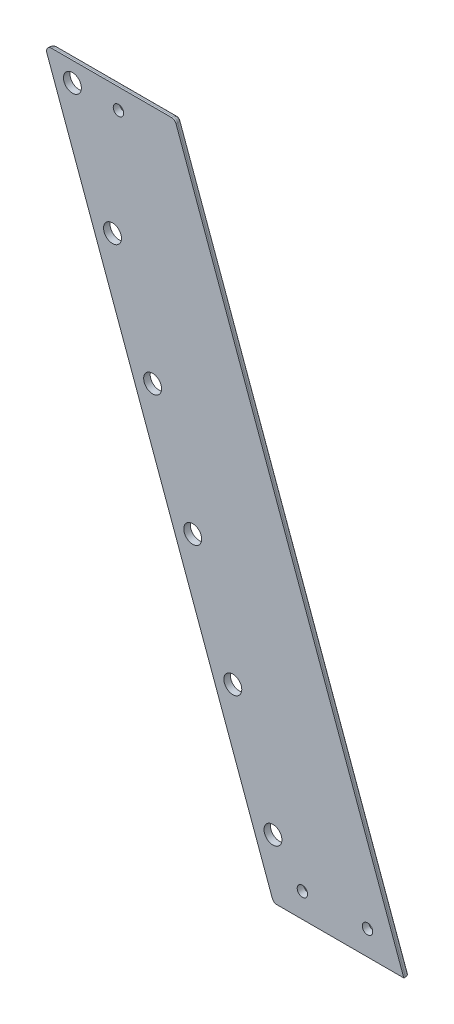
ISO-10303-21;
HEADER;
FILE_DESCRIPTION(('STEP AP214'),'2;1');
FILE_NAME('part.step','',(''),(''),'','','');
FILE_SCHEMA(('AUTOMOTIVE_DESIGN { 1 0 10303 214 1 1 1 1 }'));
ENDSEC;
DATA;
#1=APPLICATION_CONTEXT('core data for automotive mechanical design processes');
#2=APPLICATION_PROTOCOL_DEFINITION('international standard','automotive_design',2000,#1);
#3=PRODUCT_CONTEXT('',#1,'mechanical');
#4=PRODUCT('Part','Part','',(#3));
#5=PRODUCT_RELATED_PRODUCT_CATEGORY('part','',(#4));
#6=PRODUCT_DEFINITION_FORMATION('','',#4);
#7=PRODUCT_DEFINITION_CONTEXT('part definition',#1,'design');
#8=PRODUCT_DEFINITION('design','',#6,#7);
#9=PRODUCT_DEFINITION_SHAPE('','',#8);
#10=(LENGTH_UNIT() NAMED_UNIT(*) SI_UNIT(.MILLI.,.METRE.));
#11=(NAMED_UNIT(*) PLANE_ANGLE_UNIT() SI_UNIT($,.RADIAN.));
#12=(NAMED_UNIT(*) SI_UNIT($,.STERADIAN.) SOLID_ANGLE_UNIT());
#13=UNCERTAINTY_MEASURE_WITH_UNIT(LENGTH_MEASURE(1.E-05),#10,'distance_accuracy_value','');
#14=(GEOMETRIC_REPRESENTATION_CONTEXT(3) GLOBAL_UNCERTAINTY_ASSIGNED_CONTEXT((#13)) GLOBAL_UNIT_ASSIGNED_CONTEXT((#10,
#11,#12)) REPRESENTATION_CONTEXT('',''));
#15=CARTESIAN_POINT('',(0.,0.,0.));
#16=DIRECTION('',(0.,0.,1.));
#17=DIRECTION('',(1.,0.,0.));
#18=AXIS2_PLACEMENT_3D('',#15,#16,#17);
#19=CARTESIAN_POINT('',(0.,164.5,2.));
#20=DIRECTION('',(0.,1.,0.));
#21=DIRECTION('',(0.,0.,1.));
#22=AXIS2_PLACEMENT_3D('',#19,#20,#21);
#23=PLANE('',#22);
#24=DIRECTION('',(1.,0.,0.));
#25=VECTOR('',#24,1.);
#26=CARTESIAN_POINT('',(0.,164.5,0.));
#27=LINE('',#26,#25);
#28=CARTESIAN_POINT('',(-52.1049304307485,164.5,0.));
#29=VERTEX_POINT('',#28);
#30=CARTESIAN_POINT('',(-15.2726947706576,164.5,0.));
#31=VERTEX_POINT('',#30);
#32=EDGE_CURVE('E215',#29,#31,#27,.T.);
#33=ORIENTED_EDGE('',*,*,#32,.T.);
#34=CARTESIAN_POINT('',(-15.2726947706576,164.5,1.5));
#35=DIRECTION('',(0.,1.,0.));
#36=DIRECTION('',(-1.,0.,0.));
#37=AXIS2_PLACEMENT_3D('',#34,#35,#36);
#38=ELLIPSE('',#37,1.59626665871387,1.5);
#39=CARTESIAN_POINT('',(-13.6764281119449,164.5,1.5));
#40=VERTEX_POINT('',#39);
#41=EDGE_CURVE('E134',#31,#40,#38,.F.);
#42=ORIENTED_EDGE('',*,*,#41,.T.);
#43=DIRECTION('',(0.,0.,-1.));
#44=VECTOR('',#43,1.);
#45=CARTESIAN_POINT('',(-13.6764281119449,164.5,2.));
#46=LINE('',#45,#44);
#47=CARTESIAN_POINT('',(-13.6764281119449,164.5,2.));
#48=VERTEX_POINT('',#47);
#49=EDGE_CURVE('E128',#48,#40,#46,.T.);
#50=ORIENTED_EDGE('',*,*,#49,.F.);
#51=DIRECTION('',(1.,0.,0.));
#52=VECTOR('',#51,1.);
#53=CARTESIAN_POINT('',(0.,164.5,2.));
#54=LINE('',#53,#52);
#55=CARTESIAN_POINT('',(-52.6508857821478,164.5,2.));
#56=VERTEX_POINT('',#55);
#57=EDGE_CURVE('E113',#56,#48,#54,.T.);
#58=ORIENTED_EDGE('',*,*,#57,.F.);
#59=DIRECTION('',(0.,0.,-1.));
#60=VECTOR('',#59,1.);
#61=CARTESIAN_POINT('',(-52.6508857821478,164.5,0.));
#62=LINE('',#61,#60);
#63=CARTESIAN_POINT('',(-52.6508857821478,164.5,0.0904610688211416));
#64=VERTEX_POINT('',#63);
#65=EDGE_CURVE('E164',#56,#64,#62,.T.);
#66=ORIENTED_EDGE('',*,*,#65,.T.);
#67=CARTESIAN_POINT('',(-52.1049304307485,164.5,1.5));
#68=DIRECTION('',(0.,1.,0.));
#69=DIRECTION('',(1.,0.,0.));
#70=AXIS2_PLACEMENT_3D('',#67,#68,#69);
#71=ELLIPSE('',#70,1.59626665871387,1.5);
#72=EDGE_CURVE('E167',#64,#29,#71,.F.);
#73=ORIENTED_EDGE('',*,*,#72,.T.);
#74=EDGE_LOOP('',(#33,#42,#50,#58,#66,#73));
#75=FACE_BOUND('',#74,.T.);
#76=ADVANCED_FACE('F41',(#75),#23,.F.);
#77=CARTESIAN_POINT('',(40.7926909623119,14.8473252859019,2.));
#78=DIRECTION('',(-0.939692620785905,-0.342020143325678,0.));
#79=DIRECTION('',(0.342020143325678,-0.939692620785905,0.));
#80=AXIS2_PLACEMENT_3D('',#77,#78,#79);
#81=PLANE('',#80);
#82=ORIENTED_EDGE('',*,*,#49,.T.);
#83=DIRECTION('',(-0.342020143325678,0.939692620785905,0.));
#84=VECTOR('',#83,1.);
#85=CARTESIAN_POINT('',(40.7926909623119,14.8473252859019,1.5));
#86=LINE('',#85,#84);
#87=CARTESIAN_POINT('',(-83.6161119090907,356.657701956452,1.5));
#88=VERTEX_POINT('',#87);
#89=EDGE_CURVE('E59',#40,#88,#86,.T.);
#90=ORIENTED_EDGE('',*,*,#89,.T.);
#91=DIRECTION('',(0.,0.,-1.));
#92=VECTOR('',#91,1.);
#93=CARTESIAN_POINT('',(-83.6161119090907,356.657701956452,2.));
#94=LINE('',#93,#92);
#95=CARTESIAN_POINT('',(-83.6161119090907,356.657701956452,2.));
#96=VERTEX_POINT('',#95);
#97=EDGE_CURVE('E63',#88,#96,#94,.F.);
#98=ORIENTED_EDGE('',*,*,#97,.T.);
#99=DIRECTION('',(-0.342020143325678,0.939692620785905,0.));
#100=VECTOR('',#99,1.);
#101=CARTESIAN_POINT('',(40.7926909623119,14.8473252859019,2.));
#102=LINE('',#101,#100);
#103=EDGE_CURVE('E116',#48,#96,#102,.T.);
#104=ORIENTED_EDGE('',*,*,#103,.F.);
#105=EDGE_LOOP('',(#82,#90,#98,#104));
#106=FACE_BOUND('',#105,.T.);
#107=ADVANCED_FACE('F127',(#106),#81,.F.);
#108=CARTESIAN_POINT('',(0.,357.644671741463,2.));
#109=DIRECTION('',(0.,-1.,0.));
#110=DIRECTION('',(0.,0.,-1.));
#111=AXIS2_PLACEMENT_3D('',#108,#109,#110);
#112=PLANE('',#111);
#113=DIRECTION('',(-1.,0.,0.));
#114=VECTOR('',#113,1.);
#115=CARTESIAN_POINT('',(0.,357.644671741463,2.));
#116=LINE('',#115,#114);
#117=CARTESIAN_POINT('',(-85.0256508402695,357.644671741463,2.));
#118=VERTEX_POINT('',#117);
#119=CARTESIAN_POINT('',(-121.857886500359,357.644671741463,2.));
#120=VERTEX_POINT('',#119);
#121=EDGE_CURVE('E130',#118,#120,#116,.T.);
#122=ORIENTED_EDGE('',*,*,#121,.F.);
#123=DIRECTION('',(0.,0.,-1.));
#124=VECTOR('',#123,1.);
#125=CARTESIAN_POINT('',(-85.0256508402695,357.644671741463,2.));
#126=LINE('',#125,#124);
#127=CARTESIAN_POINT('',(-85.0256508402695,357.644671741463,1.5));
#128=VERTEX_POINT('',#127);
#129=EDGE_CURVE('E178',#118,#128,#126,.T.);
#130=ORIENTED_EDGE('',*,*,#129,.T.);
#131=DIRECTION('',(-1.,0.,0.));
#132=VECTOR('',#131,1.);
#133=CARTESIAN_POINT('',(0.,357.644671741463,1.5));
#134=LINE('',#133,#132);
#135=CARTESIAN_POINT('',(-121.857886500359,357.644671741463,1.5));
#136=VERTEX_POINT('',#135);
#137=EDGE_CURVE('E175',#128,#136,#134,.T.);
#138=ORIENTED_EDGE('',*,*,#137,.T.);
#139=DIRECTION('',(0.,0.,-1.));
#140=VECTOR('',#139,1.);
#141=CARTESIAN_POINT('',(-121.857886500359,357.644671741463,2.));
#142=LINE('',#141,#140);
#143=EDGE_CURVE('E172',#136,#120,#142,.F.);
#144=ORIENTED_EDGE('',*,*,#143,.T.);
#145=EDGE_LOOP('',(#122,#130,#138,#144));
#146=FACE_BOUND('',#145,.T.);
#147=ADVANCED_FACE('F280',(#146),#112,.F.);
#148=CARTESIAN_POINT('',(-44.8223226989863,172.,2.));
#149=DIRECTION('',(0.,0.,-1.));
#150=DIRECTION('',(-1.,0.,0.));
#151=AXIS2_PLACEMENT_3D('',#148,#149,#150);
#152=CYLINDRICAL_SURFACE('',#151,1.6);
#153=CARTESIAN_POINT('',(-44.8223226989863,172.,2.));
#154=DIRECTION('',(0.,0.,1.));
#155=DIRECTION('',(1.,0.,0.));
#156=AXIS2_PLACEMENT_3D('',#153,#154,#155);
#157=CIRCLE('',#156,1.6);
#158=CARTESIAN_POINT('',(-43.2223226989863,172.,2.));
#159=VERTEX_POINT('',#158);
#160=EDGE_CURVE('E144',#159,#159,#157,.T.);
#161=ORIENTED_EDGE('',*,*,#160,.T.);
#162=EDGE_LOOP('',(#161));
#163=FACE_BOUND('',#162,.T.);
#164=CARTESIAN_POINT('',(-44.8223226989863,172.,0.));
#165=DIRECTION('',(0.,0.,1.));
#166=DIRECTION('',(1.,0.,0.));
#167=AXIS2_PLACEMENT_3D('',#164,#165,#166);
#168=CIRCLE('',#167,1.6);
#169=CARTESIAN_POINT('',(-43.2223226989863,172.,0.));
#170=VERTEX_POINT('',#169);
#171=EDGE_CURVE('E249',#170,#170,#168,.T.);
#172=ORIENTED_EDGE('',*,*,#171,.F.);
#173=EDGE_LOOP('',(#172));
#174=FACE_BOUND('',#173,.T.);
#175=ADVANCED_FACE('F357',(#163,#174),#152,.F.);
#176=CARTESIAN_POINT('',(-101.299546660201,351.411510234001,2.));
#177=DIRECTION('',(0.,0.,-1.));
#178=DIRECTION('',(-1.,0.,0.));
#179=AXIS2_PLACEMENT_3D('',#176,#177,#178);
#180=CYLINDRICAL_SURFACE('',#179,1.60000000000002);
#181=CARTESIAN_POINT('',(-101.299546660201,351.411510234001,2.));
#182=DIRECTION('',(0.,0.,1.));
#183=DIRECTION('',(1.,0.,0.));
#184=AXIS2_PLACEMENT_3D('',#181,#182,#183);
#185=CIRCLE('',#184,1.60000000000002);
#186=CARTESIAN_POINT('',(-99.6995466602012,351.411510234001,2.));
#187=VERTEX_POINT('',#186);
#188=EDGE_CURVE('E350',#187,#187,#185,.T.);
#189=ORIENTED_EDGE('',*,*,#188,.T.);
#190=EDGE_LOOP('',(#189));
#191=FACE_BOUND('',#190,.T.);
#192=CARTESIAN_POINT('',(-101.299546660201,351.411510234001,0.));
#193=DIRECTION('',(0.,0.,1.));
#194=DIRECTION('',(1.,0.,0.));
#195=AXIS2_PLACEMENT_3D('',#192,#193,#194);
#196=CIRCLE('',#195,1.60000000000002);
#197=CARTESIAN_POINT('',(-99.6995466602012,351.411510234001,0.));
#198=VERTEX_POINT('',#197);
#199=EDGE_CURVE('E246',#198,#198,#196,.T.);
#200=ORIENTED_EDGE('',*,*,#199,.F.);
#201=EDGE_LOOP('',(#200));
#202=FACE_BOUND('',#201,.T.);
#203=ADVANCED_FACE('F363',(#191,#202),#180,.F.);
#204=CARTESIAN_POINT('',(-115.43122047002,351.644671741463,2.));
#205=DIRECTION('',(0.,0.,-1.));
#206=DIRECTION('',(-1.,0.,0.));
#207=AXIS2_PLACEMENT_3D('',#204,#205,#206);
#208=CYLINDRICAL_SURFACE('',#207,2.75000000000001);
#209=CARTESIAN_POINT('',(-115.43122047002,351.644671741463,2.));
#210=DIRECTION('',(0.,0.,1.));
#211=DIRECTION('',(1.,0.,0.));
#212=AXIS2_PLACEMENT_3D('',#209,#210,#211);
#213=CIRCLE('',#212,2.75000000000001);
#214=CARTESIAN_POINT('',(-112.68122047002,351.644671741463,2.));
#215=VERTEX_POINT('',#214);
#216=EDGE_CURVE('E346',#215,#215,#213,.T.);
#217=ORIENTED_EDGE('',*,*,#216,.T.);
#218=EDGE_LOOP('',(#217));
#219=FACE_BOUND('',#218,.T.);
#220=CARTESIAN_POINT('',(-115.43122047002,351.644671741463,0.));
#221=DIRECTION('',(0.,0.,1.));
#222=DIRECTION('',(1.,0.,0.));
#223=AXIS2_PLACEMENT_3D('',#220,#221,#222);
#224=CIRCLE('',#223,2.75000000000001);
#225=CARTESIAN_POINT('',(-112.68122047002,351.644671741463,0.));
#226=VERTEX_POINT('',#225);
#227=EDGE_CURVE('E242',#226,#226,#224,.T.);
#228=ORIENTED_EDGE('',*,*,#227,.F.);
#229=EDGE_LOOP('',(#228));
#230=FACE_BOUND('',#229,.T.);
#231=ADVANCED_FACE('F368',(#219,#230),#208,.F.);
#232=CARTESIAN_POINT('',(-66.1803198311229,216.328934348293,2.));
#233=DIRECTION('',(0.,0.,-1.));
#234=DIRECTION('',(-1.,0.,0.));
#235=AXIS2_PLACEMENT_3D('',#232,#233,#234);
#236=CYLINDRICAL_SURFACE('',#235,2.75000000000001);
#237=CARTESIAN_POINT('',(-66.1803198311229,216.328934348293,2.));
#238=DIRECTION('',(0.,0.,1.));
#239=DIRECTION('',(1.,0.,0.));
#240=AXIS2_PLACEMENT_3D('',#237,#238,#239);
#241=CIRCLE('',#240,2.75000000000001);
#242=CARTESIAN_POINT('',(-63.4303198311229,216.328934348293,2.));
#243=VERTEX_POINT('',#242);
#244=EDGE_CURVE('E342',#243,#243,#241,.T.);
#245=ORIENTED_EDGE('',*,*,#244,.T.);
#246=EDGE_LOOP('',(#245));
#247=FACE_BOUND('',#246,.T.);
#248=CARTESIAN_POINT('',(-66.1803198311229,216.328934348293,0.));
#249=DIRECTION('',(0.,0.,1.));
#250=DIRECTION('',(1.,0.,0.));
#251=AXIS2_PLACEMENT_3D('',#248,#249,#250);
#252=CIRCLE('',#251,2.75000000000001);
#253=CARTESIAN_POINT('',(-63.4303198311229,216.328934348293,0.));
#254=VERTEX_POINT('',#253);
#255=EDGE_CURVE('E238',#254,#254,#252,.T.);
#256=ORIENTED_EDGE('',*,*,#255,.F.);
#257=EDGE_LOOP('',(#256));
#258=FACE_BOUND('',#257,.T.);
#259=ADVANCED_FACE('F374',(#247,#258),#236,.F.);
#260=CARTESIAN_POINT('',(-78.4930449908471,250.157868696585,2.));
#261=DIRECTION('',(0.,0.,-1.));
#262=DIRECTION('',(-1.,0.,0.));
#263=AXIS2_PLACEMENT_3D('',#260,#261,#262);
#264=CYLINDRICAL_SURFACE('',#263,2.75000000000001);
#265=CARTESIAN_POINT('',(-78.4930449908471,250.157868696585,2.));
#266=DIRECTION('',(0.,0.,1.));
#267=DIRECTION('',(1.,0.,0.));
#268=AXIS2_PLACEMENT_3D('',#265,#266,#267);
#269=CIRCLE('',#268,2.75000000000001);
#270=CARTESIAN_POINT('',(-75.7430449908471,250.157868696585,2.));
#271=VERTEX_POINT('',#270);
#272=EDGE_CURVE('E338',#271,#271,#269,.T.);
#273=ORIENTED_EDGE('',*,*,#272,.T.);
#274=EDGE_LOOP('',(#273));
#275=FACE_BOUND('',#274,.T.);
#276=CARTESIAN_POINT('',(-78.4930449908471,250.157868696585,0.));
#277=DIRECTION('',(0.,0.,1.));
#278=DIRECTION('',(1.,0.,0.));
#279=AXIS2_PLACEMENT_3D('',#276,#277,#278);
#280=CIRCLE('',#279,2.75000000000001);
#281=CARTESIAN_POINT('',(-75.7430449908471,250.157868696585,0.));
#282=VERTEX_POINT('',#281);
#283=EDGE_CURVE('E234',#282,#282,#280,.T.);
#284=ORIENTED_EDGE('',*,*,#283,.F.);
#285=EDGE_LOOP('',(#284));
#286=FACE_BOUND('',#285,.T.);
#287=ADVANCED_FACE('F378',(#275,#286),#264,.F.);
#288=CARTESIAN_POINT('',(-90.8057701505713,283.986803044878,2.));
#289=DIRECTION('',(0.,0.,-1.));
#290=DIRECTION('',(-1.,0.,0.));
#291=AXIS2_PLACEMENT_3D('',#288,#289,#290);
#292=CYLINDRICAL_SURFACE('',#291,2.75000000000001);
#293=CARTESIAN_POINT('',(-90.8057701505713,283.986803044878,2.));
#294=DIRECTION('',(0.,0.,1.));
#295=DIRECTION('',(1.,0.,0.));
#296=AXIS2_PLACEMENT_3D('',#293,#294,#295);
#297=CIRCLE('',#296,2.75000000000001);
#298=CARTESIAN_POINT('',(-88.0557701505712,283.986803044878,2.));
#299=VERTEX_POINT('',#298);
#300=EDGE_CURVE('E334',#299,#299,#297,.T.);
#301=ORIENTED_EDGE('',*,*,#300,.T.);
#302=EDGE_LOOP('',(#301));
#303=FACE_BOUND('',#302,.T.);
#304=CARTESIAN_POINT('',(-90.8057701505713,283.986803044878,0.));
#305=DIRECTION('',(0.,0.,1.));
#306=DIRECTION('',(1.,0.,0.));
#307=AXIS2_PLACEMENT_3D('',#304,#305,#306);
#308=CIRCLE('',#307,2.75000000000001);
#309=CARTESIAN_POINT('',(-88.0557701505712,283.986803044878,0.));
#310=VERTEX_POINT('',#309);
#311=EDGE_CURVE('E230',#310,#310,#308,.T.);
#312=ORIENTED_EDGE('',*,*,#311,.F.);
#313=EDGE_LOOP('',(#312));
#314=FACE_BOUND('',#313,.T.);
#315=ADVANCED_FACE('F382',(#303,#314),#292,.F.);
#316=CARTESIAN_POINT('',(-103.118495310295,317.815737393171,2.));
#317=DIRECTION('',(0.,0.,-1.));
#318=DIRECTION('',(-1.,0.,0.));
#319=AXIS2_PLACEMENT_3D('',#316,#317,#318);
#320=CYLINDRICAL_SURFACE('',#319,2.75000000000001);
#321=CARTESIAN_POINT('',(-103.118495310295,317.815737393171,2.));
#322=DIRECTION('',(0.,0.,1.));
#323=DIRECTION('',(1.,0.,0.));
#324=AXIS2_PLACEMENT_3D('',#321,#322,#323);
#325=CIRCLE('',#324,2.75000000000001);
#326=CARTESIAN_POINT('',(-100.368495310295,317.815737393171,2.));
#327=VERTEX_POINT('',#326);
#328=EDGE_CURVE('E330',#327,#327,#325,.T.);
#329=ORIENTED_EDGE('',*,*,#328,.T.);
#330=EDGE_LOOP('',(#329));
#331=FACE_BOUND('',#330,.T.);
#332=CARTESIAN_POINT('',(-103.118495310295,317.815737393171,0.));
#333=DIRECTION('',(0.,0.,1.));
#334=DIRECTION('',(1.,0.,0.));
#335=AXIS2_PLACEMENT_3D('',#332,#333,#334);
#336=CIRCLE('',#335,2.75000000000001);
#337=CARTESIAN_POINT('',(-100.368495310295,317.815737393171,0.));
#338=VERTEX_POINT('',#337);
#339=EDGE_CURVE('E223',#338,#338,#336,.T.);
#340=ORIENTED_EDGE('',*,*,#339,.F.);
#341=EDGE_LOOP('',(#340));
#342=FACE_BOUND('',#341,.T.);
#343=ADVANCED_FACE('F386',(#331,#342),#320,.F.);
#344=CARTESIAN_POINT('',(-53.8675946713986,182.5,2.));
#345=DIRECTION('',(0.,0.,-1.));
#346=DIRECTION('',(-1.,0.,0.));
#347=AXIS2_PLACEMENT_3D('',#344,#345,#346);
#348=CYLINDRICAL_SURFACE('',#347,2.75);
#349=CARTESIAN_POINT('',(-53.8675946713986,182.5,2.));
#350=DIRECTION('',(0.,0.,1.));
#351=DIRECTION('',(1.,0.,0.));
#352=AXIS2_PLACEMENT_3D('',#349,#350,#351);
#353=CIRCLE('',#352,2.75);
#354=CARTESIAN_POINT('',(-51.1175946713986,182.5,2.));
#355=VERTEX_POINT('',#354);
#356=EDGE_CURVE('E324',#355,#355,#353,.T.);
#357=ORIENTED_EDGE('',*,*,#356,.T.);
#358=EDGE_LOOP('',(#357));
#359=FACE_BOUND('',#358,.T.);
#360=CARTESIAN_POINT('',(-53.8675946713986,182.5,0.));
#361=DIRECTION('',(0.,0.,1.));
#362=DIRECTION('',(1.,0.,0.));
#363=AXIS2_PLACEMENT_3D('',#360,#361,#362);
#364=CIRCLE('',#363,2.75);
#365=CARTESIAN_POINT('',(-51.1175946713986,182.5,0.));
#366=VERTEX_POINT('',#365);
#367=EDGE_CURVE('E218',#366,#366,#364,.T.);
#368=ORIENTED_EDGE('',*,*,#367,.F.);
#369=EDGE_LOOP('',(#368));
#370=FACE_BOUND('',#369,.T.);
#371=ADVANCED_FACE('F270',(#359,#370),#348,.F.);
#372=CARTESIAN_POINT('',(5.44993054237762,1.98361249624374,2.));
#373=DIRECTION('',(-0.939692620785907,-0.342020143325673,0.));
#374=DIRECTION('',(0.342020143325673,-0.939692620785907,0.));
#375=AXIS2_PLACEMENT_3D('',#372,#373,#374);
#376=PLANE('',#375);
#377=DIRECTION('',(-0.342020143325673,0.939692620785907,0.));
#378=VECTOR('',#377,1.);
#379=CARTESIAN_POINT('',(5.44993054237762,1.98361249624374,2.));
#380=LINE('',#379,#378);
#381=CARTESIAN_POINT('',(-54.0604247133267,165.486969785012,2.));
#382=VERTEX_POINT('',#381);
#383=CARTESIAN_POINT('',(-123.267425431538,355.631641526475,2.));
#384=VERTEX_POINT('',#383);
#385=EDGE_CURVE('E320',#382,#384,#380,.T.);
#386=ORIENTED_EDGE('',*,*,#385,.T.);
#387=DIRECTION('',(0.,0.,-1.));
#388=VECTOR('',#387,1.);
#389=CARTESIAN_POINT('',(-123.267425431538,355.631641526475,0.));
#390=LINE('',#389,#388);
#391=CARTESIAN_POINT('',(-123.267425431538,355.631641526475,1.5));
#392=VERTEX_POINT('',#391);
#393=EDGE_CURVE('E161',#384,#392,#390,.T.);
#394=ORIENTED_EDGE('',*,*,#393,.T.);
#395=DIRECTION('',(-0.342020143325673,0.939692620785907,0.));
#396=VECTOR('',#395,1.);
#397=CARTESIAN_POINT('',(-53.7011970894624,164.5,1.5));
#398=LINE('',#397,#396);
#399=CARTESIAN_POINT('',(-54.0604247133266,165.486969785012,1.5));
#400=VERTEX_POINT('',#399);
#401=EDGE_CURVE('E158',#392,#400,#398,.F.);
#402=ORIENTED_EDGE('',*,*,#401,.T.);
#403=DIRECTION('',(0.,0.,-1.));
#404=VECTOR('',#403,1.);
#405=CARTESIAN_POINT('',(-54.0604247133266,165.486969785012,2.));
#406=LINE('',#405,#404);
#407=EDGE_CURVE('E155',#400,#382,#406,.F.);
#408=ORIENTED_EDGE('',*,*,#407,.T.);
#409=EDGE_LOOP('',(#386,#394,#402,#408));
#410=FACE_BOUND('',#409,.T.);
#411=ADVANCED_FACE('F262',(#410),#376,.T.);
#412=CARTESIAN_POINT('',(-24.8223226989863,172.,2.));
#413=DIRECTION('',(0.,0.,-1.));
#414=DIRECTION('',(-1.,0.,0.));
#415=AXIS2_PLACEMENT_3D('',#412,#413,#414);
#416=CYLINDRICAL_SURFACE('',#415,1.6);
#417=CARTESIAN_POINT('',(-24.8223226989863,172.,2.));
#418=DIRECTION('',(0.,0.,1.));
#419=DIRECTION('',(1.,0.,0.));
#420=AXIS2_PLACEMENT_3D('',#417,#418,#419);
#421=CIRCLE('',#420,1.6);
#422=CARTESIAN_POINT('',(-23.2223226989863,172.,2.));
#423=VERTEX_POINT('',#422);
#424=EDGE_CURVE('E137',#423,#423,#421,.T.);
#425=ORIENTED_EDGE('',*,*,#424,.T.);
#426=EDGE_LOOP('',(#425));
#427=FACE_BOUND('',#426,.T.);
#428=CARTESIAN_POINT('',(-24.8223226989863,172.,0.));
#429=DIRECTION('',(0.,0.,1.));
#430=DIRECTION('',(1.,0.,0.));
#431=AXIS2_PLACEMENT_3D('',#428,#429,#430);
#432=CIRCLE('',#431,1.6);
#433=CARTESIAN_POINT('',(-23.2223226989863,172.,0.));
#434=VERTEX_POINT('',#433);
#435=EDGE_CURVE('E125',#434,#434,#432,.T.);
#436=ORIENTED_EDGE('',*,*,#435,.F.);
#437=EDGE_LOOP('',(#436));
#438=FACE_BOUND('',#437,.T.);
#439=ADVANCED_FACE('F260',(#427,#438),#416,.F.);
#440=CARTESIAN_POINT('',(0.,0.,2.));
#441=DIRECTION('',(0.,0.,1.));
#442=DIRECTION('',(1.,0.,0.));
#443=AXIS2_PLACEMENT_3D('',#440,#441,#442);
#444=PLANE('',#443);
#445=ORIENTED_EDGE('',*,*,#103,.T.);
#446=CARTESIAN_POINT('',(-85.0256508402695,356.144671741463,2.));
#447=DIRECTION('',(0.,0.,1.));
#448=DIRECTION('',(1.,0.,0.));
#449=AXIS2_PLACEMENT_3D('',#446,#447,#448);
#450=CIRCLE('',#449,1.5);
#451=EDGE_CURVE('E11',#96,#118,#450,.T.);
#452=ORIENTED_EDGE('',*,*,#451,.T.);
#453=ORIENTED_EDGE('',*,*,#121,.T.);
#454=CARTESIAN_POINT('',(-121.857886500359,356.144671741463,2.));
#455=DIRECTION('',(0.,0.,1.));
#456=DIRECTION('',(1.,0.,0.));
#457=AXIS2_PLACEMENT_3D('',#454,#455,#456);
#458=CIRCLE('',#457,1.5);
#459=EDGE_CURVE('E51',#120,#384,#458,.T.);
#460=ORIENTED_EDGE('',*,*,#459,.T.);
#461=ORIENTED_EDGE('',*,*,#385,.F.);
#462=CARTESIAN_POINT('',(-52.6508857821478,166.,2.));
#463=DIRECTION('',(0.,0.,1.));
#464=DIRECTION('',(1.,0.,0.));
#465=AXIS2_PLACEMENT_3D('',#462,#463,#464);
#466=CIRCLE('',#465,1.5);
#467=EDGE_CURVE('E120',#382,#56,#466,.T.);
#468=ORIENTED_EDGE('',*,*,#467,.T.);
#469=ORIENTED_EDGE('',*,*,#57,.T.);
#470=EDGE_LOOP('',(#445,#452,#453,#460,#461,#468,#469));
#471=FACE_BOUND('',#470,.T.);
#472=ORIENTED_EDGE('',*,*,#356,.F.);
#473=EDGE_LOOP('',(#472));
#474=FACE_BOUND('',#473,.T.);
#475=ORIENTED_EDGE('',*,*,#328,.F.);
#476=EDGE_LOOP('',(#475));
#477=FACE_BOUND('',#476,.T.);
#478=ORIENTED_EDGE('',*,*,#300,.F.);
#479=EDGE_LOOP('',(#478));
#480=FACE_BOUND('',#479,.T.);
#481=ORIENTED_EDGE('',*,*,#272,.F.);
#482=EDGE_LOOP('',(#481));
#483=FACE_BOUND('',#482,.T.);
#484=ORIENTED_EDGE('',*,*,#244,.F.);
#485=EDGE_LOOP('',(#484));
#486=FACE_BOUND('',#485,.T.);
#487=ORIENTED_EDGE('',*,*,#216,.F.);
#488=EDGE_LOOP('',(#487));
#489=FACE_BOUND('',#488,.T.);
#490=ORIENTED_EDGE('',*,*,#188,.F.);
#491=EDGE_LOOP('',(#490));
#492=FACE_BOUND('',#491,.T.);
#493=ORIENTED_EDGE('',*,*,#160,.F.);
#494=EDGE_LOOP('',(#493));
#495=FACE_BOUND('',#494,.T.);
#496=ORIENTED_EDGE('',*,*,#424,.F.);
#497=EDGE_LOOP('',(#496));
#498=FACE_BOUND('',#497,.T.);
#499=ADVANCED_FACE('F114',(#471,#474,#477,#480,#483,#486,#489,#492,#495,#498),#444,.T.);
#500=CARTESIAN_POINT('',(0.,0.,0.));
#501=DIRECTION('',(0.,0.,1.));
#502=DIRECTION('',(1.,0.,0.));
#503=AXIS2_PLACEMENT_3D('',#500,#501,#502);
#504=PLANE('',#503);
#505=ORIENTED_EDGE('',*,*,#32,.F.);
#506=DIRECTION('',(-0.342020143325673,0.939692620785907,0.));
#507=VECTOR('',#506,1.);
#508=CARTESIAN_POINT('',(-122.590569579294,358.157701956452,0.));
#509=LINE('',#508,#507);
#510=CARTESIAN_POINT('',(-121.857886500359,356.144671741463,0.));
#511=VERTEX_POINT('',#510);
#512=EDGE_CURVE('E151',#29,#511,#509,.T.);
#513=ORIENTED_EDGE('',*,*,#512,.T.);
#514=DIRECTION('',(-1.,0.,0.));
#515=VECTOR('',#514,1.);
#516=CARTESIAN_POINT('',(0.,356.144671741463,0.));
#517=LINE('',#516,#515);
#518=CARTESIAN_POINT('',(-85.0256508402695,356.144671741463,0.));
#519=VERTEX_POINT('',#518);
#520=EDGE_CURVE('E141',#511,#519,#517,.F.);
#521=ORIENTED_EDGE('',*,*,#520,.T.);
#522=DIRECTION('',(-0.342020143325678,0.939692620785905,0.));
#523=VECTOR('',#522,1.);
#524=CARTESIAN_POINT('',(39.3831520311331,14.3342950709134,0.));
#525=LINE('',#524,#523);
#526=EDGE_CURVE('E136',#519,#31,#525,.F.);
#527=ORIENTED_EDGE('',*,*,#526,.T.);
#528=EDGE_LOOP('',(#505,#513,#521,#527));
#529=FACE_BOUND('',#528,.T.);
#530=ORIENTED_EDGE('',*,*,#367,.T.);
#531=EDGE_LOOP('',(#530));
#532=FACE_BOUND('',#531,.T.);
#533=ORIENTED_EDGE('',*,*,#339,.T.);
#534=EDGE_LOOP('',(#533));
#535=FACE_BOUND('',#534,.T.);
#536=ORIENTED_EDGE('',*,*,#311,.T.);
#537=EDGE_LOOP('',(#536));
#538=FACE_BOUND('',#537,.T.);
#539=ORIENTED_EDGE('',*,*,#283,.T.);
#540=EDGE_LOOP('',(#539));
#541=FACE_BOUND('',#540,.T.);
#542=ORIENTED_EDGE('',*,*,#255,.T.);
#543=EDGE_LOOP('',(#542));
#544=FACE_BOUND('',#543,.T.);
#545=ORIENTED_EDGE('',*,*,#227,.T.);
#546=EDGE_LOOP('',(#545));
#547=FACE_BOUND('',#546,.T.);
#548=ORIENTED_EDGE('',*,*,#199,.T.);
#549=EDGE_LOOP('',(#548));
#550=FACE_BOUND('',#549,.T.);
#551=ORIENTED_EDGE('',*,*,#171,.T.);
#552=EDGE_LOOP('',(#551));
#553=FACE_BOUND('',#552,.T.);
#554=ORIENTED_EDGE('',*,*,#435,.T.);
#555=EDGE_LOOP('',(#554));
#556=FACE_BOUND('',#555,.T.);
#557=ADVANCED_FACE('F258',(#529,#532,#535,#538,#541,#544,#547,#550,#553,#556),#504,.F.);
#558=CARTESIAN_POINT('',(39.3831520311331,14.3342950709134,1.5));
#559=DIRECTION('',(-0.342020143325678,0.939692620785905,0.));
#560=DIRECTION('',(-0.939692620785905,-0.342020143325678,0.));
#561=AXIS2_PLACEMENT_3D('',#558,#559,#560);
#562=CYLINDRICAL_SURFACE('',#561,1.5);
#563=ORIENTED_EDGE('',*,*,#41,.F.);
#564=ORIENTED_EDGE('',*,*,#526,.F.);
#565=CARTESIAN_POINT('',(-85.0256508402695,356.144671741463,1.5));
#566=DIRECTION('',(-0.342020143325666,0.939692620785909,0.));
#567=DIRECTION('',(-0.939692620785909,-0.342020143325666,0.));
#568=AXIS2_PLACEMENT_3D('',#565,#566,#567);
#569=CIRCLE('',#568,1.5);
#570=EDGE_CURVE('E45',#88,#519,#569,.T.);
#571=ORIENTED_EDGE('',*,*,#570,.F.);
#572=ORIENTED_EDGE('',*,*,#89,.F.);
#573=EDGE_LOOP('',(#563,#564,#571,#572));
#574=FACE_BOUND('',#573,.T.);
#575=ADVANCED_FACE('F43',(#574),#562,.T.);
#576=CARTESIAN_POINT('',(-85.0256508402695,356.144671741463,2.));
#577=DIRECTION('',(0.,0.,-1.));
#578=DIRECTION('',(-1.,0.,0.));
#579=AXIS2_PLACEMENT_3D('',#576,#577,#578);
#580=CYLINDRICAL_SURFACE('',#579,1.5);
#581=ORIENTED_EDGE('',*,*,#451,.F.);
#582=ORIENTED_EDGE('',*,*,#97,.F.);
#583=CARTESIAN_POINT('',(-85.0256508402695,356.144671741463,1.5));
#584=DIRECTION('',(0.,0.,-1.));
#585=DIRECTION('',(-1.,0.,0.));
#586=AXIS2_PLACEMENT_3D('',#583,#584,#585);
#587=CIRCLE('',#586,1.5);
#588=EDGE_CURVE('E207',#128,#88,#587,.T.);
#589=ORIENTED_EDGE('',*,*,#588,.F.);
#590=ORIENTED_EDGE('',*,*,#129,.F.);
#591=EDGE_LOOP('',(#581,#582,#589,#590));
#592=FACE_BOUND('',#591,.T.);
#593=ADVANCED_FACE('F306',(#592),#580,.T.);
#594=CARTESIAN_POINT('',(-85.0256508402695,356.144671741463,1.5));
#595=DIRECTION('',(0.,0.,1.));
#596=DIRECTION('',(1.,0.,0.));
#597=AXIS2_PLACEMENT_3D('',#594,#595,#596);
#598=SPHERICAL_SURFACE('',#597,1.5);
#599=ORIENTED_EDGE('',*,*,#588,.T.);
#600=ORIENTED_EDGE('',*,*,#570,.T.);
#601=CARTESIAN_POINT('',(-85.0256508402695,356.144671741463,1.5));
#602=DIRECTION('',(1.,0.,0.));
#603=DIRECTION('',(0.,1.,0.));
#604=AXIS2_PLACEMENT_3D('',#601,#602,#603);
#605=CIRCLE('',#604,1.5);
#606=EDGE_CURVE('E204',#128,#519,#605,.F.);
#607=ORIENTED_EDGE('',*,*,#606,.F.);
#608=EDGE_LOOP('',(#599,#600,#607));
#609=FACE_BOUND('',#608,.T.);
#610=ADVANCED_FACE('F303',(#609),#598,.T.);
#611=CARTESIAN_POINT('',(0.,356.144671741463,1.5));
#612=DIRECTION('',(-1.,0.,0.));
#613=DIRECTION('',(0.,0.,1.));
#614=AXIS2_PLACEMENT_3D('',#611,#612,#613);
#615=CYLINDRICAL_SURFACE('',#614,1.5);
#616=ORIENTED_EDGE('',*,*,#606,.T.);
#617=ORIENTED_EDGE('',*,*,#520,.F.);
#618=CARTESIAN_POINT('',(-121.857886500359,356.144671741463,1.5));
#619=DIRECTION('',(-1.,0.,0.));
#620=DIRECTION('',(0.,0.,1.));
#621=AXIS2_PLACEMENT_3D('',#618,#619,#620);
#622=CIRCLE('',#621,1.5);
#623=EDGE_CURVE('E200',#136,#511,#622,.T.);
#624=ORIENTED_EDGE('',*,*,#623,.F.);
#625=ORIENTED_EDGE('',*,*,#137,.F.);
#626=EDGE_LOOP('',(#616,#617,#624,#625));
#627=FACE_BOUND('',#626,.T.);
#628=ADVANCED_FACE('F299',(#627),#615,.T.);
#629=CARTESIAN_POINT('',(-121.857886500359,356.144671741463,2.));
#630=DIRECTION('',(0.,0.,1.));
#631=DIRECTION('',(1.,0.,0.));
#632=AXIS2_PLACEMENT_3D('',#629,#630,#631);
#633=CYLINDRICAL_SURFACE('',#632,1.5);
#634=ORIENTED_EDGE('',*,*,#459,.F.);
#635=ORIENTED_EDGE('',*,*,#143,.F.);
#636=CARTESIAN_POINT('',(-121.857886500359,356.144671741463,1.5));
#637=DIRECTION('',(0.,0.,-1.));
#638=DIRECTION('',(-1.,0.,0.));
#639=AXIS2_PLACEMENT_3D('',#636,#637,#638);
#640=CIRCLE('',#639,1.5);
#641=EDGE_CURVE('E196',#392,#136,#640,.T.);
#642=ORIENTED_EDGE('',*,*,#641,.F.);
#643=ORIENTED_EDGE('',*,*,#393,.F.);
#644=EDGE_LOOP('',(#634,#635,#642,#643));
#645=FACE_BOUND('',#644,.T.);
#646=ADVANCED_FACE('F295',(#645),#633,.T.);
#647=CARTESIAN_POINT('',(-52.6508857821478,166.,2.));
#648=DIRECTION('',(0.,0.,1.));
#649=DIRECTION('',(1.,0.,0.));
#650=AXIS2_PLACEMENT_3D('',#647,#648,#649);
#651=CYLINDRICAL_SURFACE('',#650,1.5);
#652=ORIENTED_EDGE('',*,*,#467,.F.);
#653=ORIENTED_EDGE('',*,*,#407,.F.);
#654=CARTESIAN_POINT('',(-52.6508857821478,166.,1.5));
#655=DIRECTION('',(0.241844762647978,-0.664463024388674,0.707106781186547));
#656=DIRECTION('',(-0.241844762647978,0.664463024388674,0.707106781186547));
#657=AXIS2_PLACEMENT_3D('',#654,#655,#656);
#658=ELLIPSE('',#657,2.12132034355964,1.5);
#659=EDGE_CURVE('E192',#64,#400,#658,.F.);
#660=ORIENTED_EDGE('',*,*,#659,.F.);
#661=ORIENTED_EDGE('',*,*,#65,.F.);
#662=EDGE_LOOP('',(#652,#653,#660,#661));
#663=FACE_BOUND('',#662,.T.);
#664=ADVANCED_FACE('F291',(#663),#651,.T.);
#665=CARTESIAN_POINT('',(-121.857886500359,356.144671741463,1.5));
#666=DIRECTION('',(0.,0.,1.));
#667=DIRECTION('',(1.,0.,0.));
#668=AXIS2_PLACEMENT_3D('',#665,#666,#667);
#669=SPHERICAL_SURFACE('',#668,1.5);
#670=ORIENTED_EDGE('',*,*,#641,.T.);
#671=ORIENTED_EDGE('',*,*,#623,.T.);
#672=CARTESIAN_POINT('',(-121.857886500359,356.144671741463,1.5));
#673=DIRECTION('',(-0.342020143325666,0.939692620785909,0.));
#674=DIRECTION('',(-0.939692620785909,-0.342020143325666,0.));
#675=AXIS2_PLACEMENT_3D('',#672,#673,#674);
#676=CIRCLE('',#675,1.5);
#677=EDGE_CURVE('E189',#392,#511,#676,.F.);
#678=ORIENTED_EDGE('',*,*,#677,.F.);
#679=EDGE_LOOP('',(#670,#671,#678));
#680=FACE_BOUND('',#679,.T.);
#681=ADVANCED_FACE('F287',(#680),#669,.T.);
#682=CARTESIAN_POINT('',(6.85946947355647,2.49664271123225,1.5));
#683=DIRECTION('',(0.342020143325673,-0.939692620785907,0.));
#684=DIRECTION('',(0.939692620785907,0.342020143325673,0.));
#685=AXIS2_PLACEMENT_3D('',#682,#683,#684);
#686=CYLINDRICAL_SURFACE('',#685,1.5);
#687=ORIENTED_EDGE('',*,*,#659,.T.);
#688=ORIENTED_EDGE('',*,*,#401,.F.);
#689=ORIENTED_EDGE('',*,*,#677,.T.);
#690=ORIENTED_EDGE('',*,*,#512,.F.);
#691=ORIENTED_EDGE('',*,*,#72,.F.);
#692=EDGE_LOOP('',(#687,#688,#689,#690,#691));
#693=FACE_BOUND('',#692,.T.);
#694=ADVANCED_FACE('F284',(#693),#686,.T.);
#695=CLOSED_SHELL('',(#76,#107,#147,#175,#203,#231,#259,#287,#315,#343,#371,#411,#439,#499,#557,
#575,#593,#610,#628,#646,#664,#681,#694));
#696=MANIFOLD_SOLID_BREP('B2',#695);
#697=ADVANCED_BREP_SHAPE_REPRESENTATION('',(#18,#696),#14);
#698=SHAPE_DEFINITION_REPRESENTATION(#9,#697);
ENDSEC;
END-ISO-10303-21;
